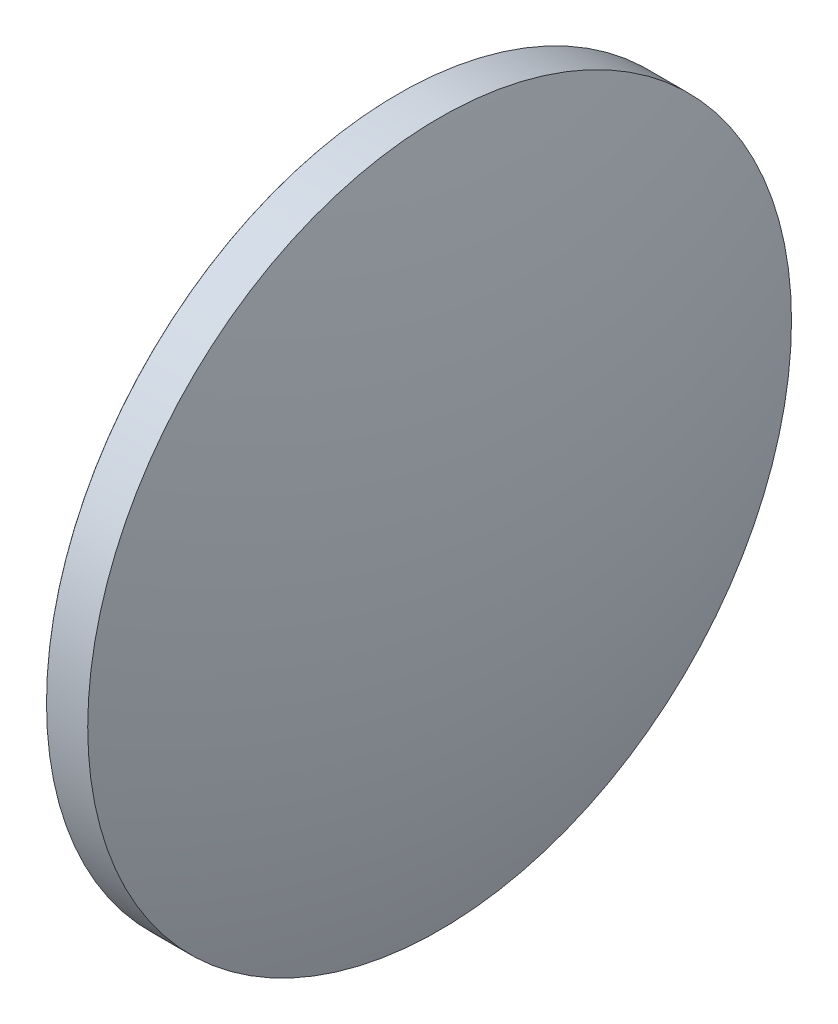
ISO-10303-21;
HEADER;
FILE_DESCRIPTION(('STEP AP214'),'2;1');
FILE_NAME('part.step','',(''),(''),'','','');
FILE_SCHEMA(('AUTOMOTIVE_DESIGN { 1 0 10303 214 1 1 1 1 }'));
ENDSEC;
DATA;
#1=APPLICATION_CONTEXT('core data for automotive mechanical design processes');
#2=APPLICATION_PROTOCOL_DEFINITION('international standard','automotive_design',2000,#1);
#3=PRODUCT_CONTEXT('',#1,'mechanical');
#4=PRODUCT('Part','Part','',(#3));
#5=PRODUCT_RELATED_PRODUCT_CATEGORY('part','',(#4));
#6=PRODUCT_DEFINITION_FORMATION('','',#4);
#7=PRODUCT_DEFINITION_CONTEXT('part definition',#1,'design');
#8=PRODUCT_DEFINITION('design','',#6,#7);
#9=PRODUCT_DEFINITION_SHAPE('','',#8);
#10=(LENGTH_UNIT() NAMED_UNIT(*) SI_UNIT(.MILLI.,.METRE.));
#11=(NAMED_UNIT(*) PLANE_ANGLE_UNIT() SI_UNIT($,.RADIAN.));
#12=(NAMED_UNIT(*) SI_UNIT($,.STERADIAN.) SOLID_ANGLE_UNIT());
#13=UNCERTAINTY_MEASURE_WITH_UNIT(LENGTH_MEASURE(1.E-05),#10,'distance_accuracy_value','');
#14=(GEOMETRIC_REPRESENTATION_CONTEXT(3) GLOBAL_UNCERTAINTY_ASSIGNED_CONTEXT((#13)) GLOBAL_UNIT_ASSIGNED_CONTEXT((#10,
#11,#12)) REPRESENTATION_CONTEXT('',''));
#15=CARTESIAN_POINT('',(0.,0.,0.));
#16=DIRECTION('',(0.,0.,1.));
#17=DIRECTION('',(1.,0.,0.));
#18=AXIS2_PLACEMENT_3D('',#15,#16,#17);
#19=CARTESIAN_POINT('',(-3.3,0.,0.));
#20=DIRECTION('',(1.,0.,0.));
#21=DIRECTION('',(0.,0.,-1.));
#22=AXIS2_PLACEMENT_3D('',#19,#20,#21);
#23=PLANE('',#22);
#24=CARTESIAN_POINT('',(-3.3,0.,0.));
#25=DIRECTION('',(1.,0.,0.));
#26=DIRECTION('',(0.,0.,-1.));
#27=AXIS2_PLACEMENT_3D('',#24,#25,#26);
#28=CIRCLE('',#27,25.375);
#29=CARTESIAN_POINT('',(-3.3,0.,-25.375));
#30=VERTEX_POINT('',#29);
#31=EDGE_CURVE('E22',#30,#30,#28,.F.);
#32=ORIENTED_EDGE('',*,*,#31,.T.);
#33=EDGE_LOOP('',(#32));
#34=FACE_BOUND('',#33,.T.);
#35=ADVANCED_FACE('F15',(#34),#23,.F.);
#36=CARTESIAN_POINT('',(-3.3,0.,0.));
#37=DIRECTION('',(-1.,0.,0.));
#38=DIRECTION('',(0.,0.,1.));
#39=AXIS2_PLACEMENT_3D('',#36,#37,#38);
#40=CYLINDRICAL_SURFACE('',#39,25.4);
#41=CARTESIAN_POINT('',(-3.27500000000001,0.,0.));
#42=DIRECTION('',(1.,0.,0.));
#43=DIRECTION('',(0.,0.,-1.));
#44=AXIS2_PLACEMENT_3D('',#41,#42,#43);
#45=CIRCLE('',#44,25.4);
#46=CARTESIAN_POINT('',(-3.27500000000001,0.,-25.4));
#47=VERTEX_POINT('',#46);
#48=EDGE_CURVE('E10',#47,#47,#45,.T.);
#49=ORIENTED_EDGE('',*,*,#48,.T.);
#50=EDGE_LOOP('',(#49));
#51=FACE_BOUND('',#50,.T.);
#52=CARTESIAN_POINT('',(-0.299999999999995,0.,0.));
#53=DIRECTION('',(-1.,0.,0.));
#54=DIRECTION('',(0.,0.,1.));
#55=AXIS2_PLACEMENT_3D('',#52,#53,#54);
#56=CIRCLE('',#55,25.4);
#57=CARTESIAN_POINT('',(-0.299999999999995,0.,25.4));
#58=VERTEX_POINT('',#57);
#59=EDGE_CURVE('E46',#58,#58,#56,.T.);
#60=ORIENTED_EDGE('',*,*,#59,.T.);
#61=EDGE_LOOP('',(#60));
#62=FACE_BOUND('',#61,.T.);
#63=ADVANCED_FACE('F27',(#51,#62),#40,.T.);
#64=CARTESIAN_POINT('',(-88.6999614267691,0.,-0.0842465014318367));
#65=DIRECTION('',(0.,-1.,0.));
#66=DIRECTION('',(0.,0.,1.));
#67=AXIS2_PLACEMENT_3D('',#64,#65,#66);
#68=CIRCLE('',#67,92.);
#69=TRIMMED_CURVE('',#68,(PARAMETER_VALUE(-1.56988060382527)),
(PARAMETER_VALUE(1.56988060382527)),.T.,.PARAMETER.);
#70=CARTESIAN_POINT('',(-88.6999614267691,0.,0.));
#71=DIRECTION('',(-1.,0.,0.));
#72=AXIS1_PLACEMENT('',#70,#71);
#73=SURFACE_OF_REVOLUTION('',#69,#72);
#74=ORIENTED_EDGE('',*,*,#59,.F.);
#75=EDGE_LOOP('',(#74));
#76=FACE_BOUND('',#75,.T.);
#77=CARTESIAN_POINT('',(3.3,0.,0.));
#78=VERTEX_POINT('',#77);
#79=VERTEX_LOOP('',#78);
#80=FACE_BOUND('',#79,.T.);
#81=ADVANCED_FACE('F25',(#76,#80),#73,.T.);
#82=CARTESIAN_POINT('',(-3.3,0.,0.));
#83=DIRECTION('',(1.,0.,0.));
#84=DIRECTION('',(0.,0.,-1.));
#85=AXIS2_PLACEMENT_3D('',#82,#83,#84);
#86=CONICAL_SURFACE('',#85,25.375,0.785398163397448);
#87=ORIENTED_EDGE('',*,*,#48,.F.);
#88=EDGE_LOOP('',(#87));
#89=FACE_BOUND('',#88,.T.);
#90=ORIENTED_EDGE('',*,*,#31,.F.);
#91=EDGE_LOOP('',(#90));
#92=FACE_BOUND('',#91,.T.);
#93=ADVANCED_FACE('F17',(#89,#92),#86,.T.);
#94=CLOSED_SHELL('',(#35,#63,#81,#93));
#95=MANIFOLD_SOLID_BREP('B1',#94);
#96=ADVANCED_BREP_SHAPE_REPRESENTATION('',(#18,#95),#14);
#97=SHAPE_DEFINITION_REPRESENTATION(#9,#96);
ENDSEC;
END-ISO-10303-21;
